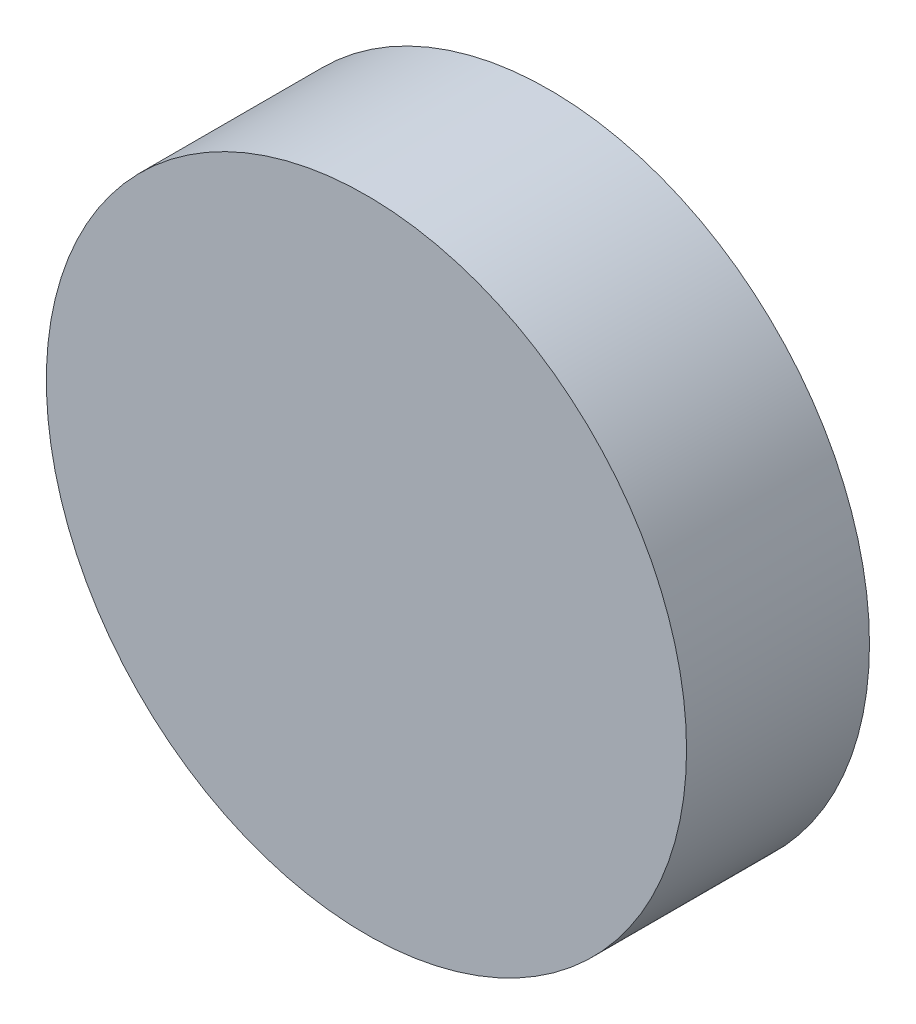
ISO-10303-21;
HEADER;
FILE_DESCRIPTION(('STEP AP214'),'2;1');
FILE_NAME('part.step','',(''),(''),'','','');
FILE_SCHEMA(('AUTOMOTIVE_DESIGN { 1 0 10303 214 1 1 1 1 }'));
ENDSEC;
DATA;
#1=APPLICATION_CONTEXT('core data for automotive mechanical design processes');
#2=APPLICATION_PROTOCOL_DEFINITION('international standard','automotive_design',2000,#1);
#3=PRODUCT_CONTEXT('',#1,'mechanical');
#4=PRODUCT('Part','Part','',(#3));
#5=PRODUCT_RELATED_PRODUCT_CATEGORY('part','',(#4));
#6=PRODUCT_DEFINITION_FORMATION('','',#4);
#7=PRODUCT_DEFINITION_CONTEXT('part definition',#1,'design');
#8=PRODUCT_DEFINITION('design','',#6,#7);
#9=PRODUCT_DEFINITION_SHAPE('','',#8);
#10=(LENGTH_UNIT() NAMED_UNIT(*) SI_UNIT(.MILLI.,.METRE.));
#11=(NAMED_UNIT(*) PLANE_ANGLE_UNIT() SI_UNIT($,.RADIAN.));
#12=(NAMED_UNIT(*) SI_UNIT($,.STERADIAN.) SOLID_ANGLE_UNIT());
#13=UNCERTAINTY_MEASURE_WITH_UNIT(LENGTH_MEASURE(1.E-05),#10,'distance_accuracy_value','');
#14=(GEOMETRIC_REPRESENTATION_CONTEXT(3) GLOBAL_UNCERTAINTY_ASSIGNED_CONTEXT((#13)) GLOBAL_UNIT_ASSIGNED_CONTEXT((#10,
#11,#12)) REPRESENTATION_CONTEXT('',''));
#15=CARTESIAN_POINT('',(0.,0.,0.));
#16=DIRECTION('',(0.,0.,1.));
#17=DIRECTION('',(1.,0.,0.));
#18=AXIS2_PLACEMENT_3D('',#15,#16,#17);
#19=CARTESIAN_POINT('',(0.,0.,1.));
#20=DIRECTION('',(0.,0.,-1.));
#21=DIRECTION('',(-1.,0.,0.));
#22=AXIS2_PLACEMENT_3D('',#19,#20,#21);
#23=CYLINDRICAL_SURFACE('',#22,1.75);
#24=CARTESIAN_POINT('',(0.,0.,1.));
#25=DIRECTION('',(0.,0.,1.));
#26=DIRECTION('',(1.,0.,0.));
#27=AXIS2_PLACEMENT_3D('',#24,#25,#26);
#28=CIRCLE('',#27,1.75);
#29=CARTESIAN_POINT('',(1.75,0.,1.));
#30=VERTEX_POINT('',#29);
#31=EDGE_CURVE('E10',#30,#30,#28,.T.);
#32=ORIENTED_EDGE('',*,*,#31,.F.);
#33=EDGE_LOOP('',(#32));
#34=FACE_BOUND('',#33,.T.);
#35=CARTESIAN_POINT('',(0.,0.,0.));
#36=DIRECTION('',(0.,0.,1.));
#37=DIRECTION('',(1.,0.,0.));
#38=AXIS2_PLACEMENT_3D('',#35,#36,#37);
#39=CIRCLE('',#38,1.75);
#40=CARTESIAN_POINT('',(1.75,0.,0.));
#41=VERTEX_POINT('',#40);
#42=EDGE_CURVE('E34',#41,#41,#39,.T.);
#43=ORIENTED_EDGE('',*,*,#42,.T.);
#44=EDGE_LOOP('',(#43));
#45=FACE_BOUND('',#44,.T.);
#46=ADVANCED_FACE('F31',(#34,#45),#23,.T.);
#47=CARTESIAN_POINT('',(0.,0.,1.));
#48=DIRECTION('',(0.,0.,1.));
#49=DIRECTION('',(1.,0.,0.));
#50=AXIS2_PLACEMENT_3D('',#47,#48,#49);
#51=PLANE('',#50);
#52=ORIENTED_EDGE('',*,*,#31,.T.);
#53=EDGE_LOOP('',(#52));
#54=FACE_BOUND('',#53,.T.);
#55=ADVANCED_FACE('F46',(#54),#51,.T.);
#56=CARTESIAN_POINT('',(0.,0.,0.));
#57=DIRECTION('',(0.,0.,1.));
#58=DIRECTION('',(1.,0.,0.));
#59=AXIS2_PLACEMENT_3D('',#56,#57,#58);
#60=PLANE('',#59);
#61=ORIENTED_EDGE('',*,*,#42,.F.);
#62=EDGE_LOOP('',(#61));
#63=FACE_BOUND('',#62,.T.);
#64=ADVANCED_FACE('F44',(#63),#60,.F.);
#65=CLOSED_SHELL('',(#46,#55,#64));
#66=MANIFOLD_SOLID_BREP('B2',#65);
#67=ADVANCED_BREP_SHAPE_REPRESENTATION('',(#18,#66),#14);
#68=SHAPE_DEFINITION_REPRESENTATION(#9,#67);
ENDSEC;
END-ISO-10303-21;
